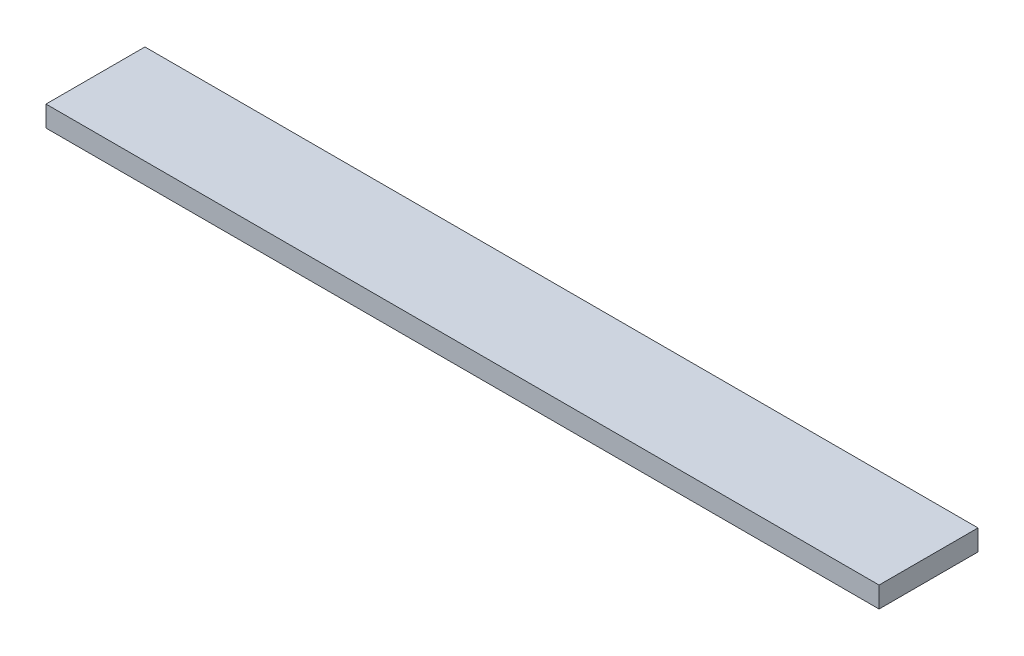
ISO-10303-21;
HEADER;
FILE_DESCRIPTION(('STEP AP214'),'2;1');
FILE_NAME('part.step','',(''),(''),'','','');
FILE_SCHEMA(('AUTOMOTIVE_DESIGN { 1 0 10303 214 1 1 1 1 }'));
ENDSEC;
DATA;
#1=APPLICATION_CONTEXT('core data for automotive mechanical design processes');
#2=APPLICATION_PROTOCOL_DEFINITION('international standard','automotive_design',2000,#1);
#3=PRODUCT_CONTEXT('',#1,'mechanical');
#4=PRODUCT('Part','Part','',(#3));
#5=PRODUCT_RELATED_PRODUCT_CATEGORY('part','',(#4));
#6=PRODUCT_DEFINITION_FORMATION('','',#4);
#7=PRODUCT_DEFINITION_CONTEXT('part definition',#1,'design');
#8=PRODUCT_DEFINITION('design','',#6,#7);
#9=PRODUCT_DEFINITION_SHAPE('','',#8);
#10=(LENGTH_UNIT() NAMED_UNIT(*) SI_UNIT(.MILLI.,.METRE.));
#11=(NAMED_UNIT(*) PLANE_ANGLE_UNIT() SI_UNIT($,.RADIAN.));
#12=(NAMED_UNIT(*) SI_UNIT($,.STERADIAN.) SOLID_ANGLE_UNIT());
#13=UNCERTAINTY_MEASURE_WITH_UNIT(LENGTH_MEASURE(1.E-05),#10,'distance_accuracy_value','');
#14=(GEOMETRIC_REPRESENTATION_CONTEXT(3) GLOBAL_UNCERTAINTY_ASSIGNED_CONTEXT((#13)) GLOBAL_UNIT_ASSIGNED_CONTEXT((#10,
#11,#12)) REPRESENTATION_CONTEXT('',''));
#15=CARTESIAN_POINT('',(0.,0.,0.));
#16=DIRECTION('',(0.,0.,1.));
#17=DIRECTION('',(1.,0.,0.));
#18=AXIS2_PLACEMENT_3D('',#15,#16,#17);
#19=CARTESIAN_POINT('',(0.,2.54,0.));
#20=DIRECTION('',(1.,0.,0.));
#21=DIRECTION('',(0.,0.,-1.));
#22=AXIS2_PLACEMENT_3D('',#19,#20,#21);
#23=PLANE('',#22);
#24=DIRECTION('',(0.,0.,1.));
#25=VECTOR('',#24,1.);
#26=CARTESIAN_POINT('',(0.,0.,0.));
#27=LINE('',#26,#25);
#28=CARTESIAN_POINT('',(0.,0.,-12.065));
#29=VERTEX_POINT('',#28);
#30=CARTESIAN_POINT('',(0.,0.,0.));
#31=VERTEX_POINT('',#30);
#32=EDGE_CURVE('E107',#29,#31,#27,.T.);
#33=ORIENTED_EDGE('',*,*,#32,.T.);
#34=DIRECTION('',(0.,-1.,0.));
#35=VECTOR('',#34,1.);
#36=CARTESIAN_POINT('',(0.,2.54,0.));
#37=LINE('',#36,#35);
#38=CARTESIAN_POINT('',(0.,2.54,0.));
#39=VERTEX_POINT('',#38);
#40=EDGE_CURVE('E11',#39,#31,#37,.T.);
#41=ORIENTED_EDGE('',*,*,#40,.F.);
#42=DIRECTION('',(0.,0.,1.));
#43=VECTOR('',#42,1.);
#44=CARTESIAN_POINT('',(0.,2.54,0.));
#45=LINE('',#44,#43);
#46=CARTESIAN_POINT('',(0.,2.54,-12.065));
#47=VERTEX_POINT('',#46);
#48=EDGE_CURVE('E91',#47,#39,#45,.T.);
#49=ORIENTED_EDGE('',*,*,#48,.F.);
#50=DIRECTION('',(0.,-1.,0.));
#51=VECTOR('',#50,1.);
#52=CARTESIAN_POINT('',(0.,2.54,-12.065));
#53=LINE('',#52,#51);
#54=EDGE_CURVE('E103',#47,#29,#53,.T.);
#55=ORIENTED_EDGE('',*,*,#54,.T.);
#56=EDGE_LOOP('',(#33,#41,#49,#55));
#57=FACE_BOUND('',#56,.T.);
#58=ADVANCED_FACE('F39',(#57),#23,.F.);
#59=CARTESIAN_POINT('',(0.,2.54,0.));
#60=DIRECTION('',(0.,0.,-1.));
#61=DIRECTION('',(-1.,0.,0.));
#62=AXIS2_PLACEMENT_3D('',#59,#60,#61);
#63=PLANE('',#62);
#64=DIRECTION('',(1.,0.,0.));
#65=VECTOR('',#64,1.);
#66=CARTESIAN_POINT('',(0.,0.,0.));
#67=LINE('',#66,#65);
#68=CARTESIAN_POINT('',(101.6,0.,0.));
#69=VERTEX_POINT('',#68);
#70=EDGE_CURVE('E96',#31,#69,#67,.T.);
#71=ORIENTED_EDGE('',*,*,#70,.T.);
#72=DIRECTION('',(0.,-1.,0.));
#73=VECTOR('',#72,1.);
#74=CARTESIAN_POINT('',(101.6,2.54,0.));
#75=LINE('',#74,#73);
#76=CARTESIAN_POINT('',(101.6,2.54,0.));
#77=VERTEX_POINT('',#76);
#78=EDGE_CURVE('E48',#77,#69,#75,.T.);
#79=ORIENTED_EDGE('',*,*,#78,.F.);
#80=DIRECTION('',(1.,0.,0.));
#81=VECTOR('',#80,1.);
#82=CARTESIAN_POINT('',(0.,2.54,0.));
#83=LINE('',#82,#81);
#84=EDGE_CURVE('E86',#39,#77,#83,.T.);
#85=ORIENTED_EDGE('',*,*,#84,.F.);
#86=ORIENTED_EDGE('',*,*,#40,.T.);
#87=EDGE_LOOP('',(#71,#79,#85,#86));
#88=FACE_BOUND('',#87,.T.);
#89=ADVANCED_FACE('F95',(#88),#63,.F.);
#90=CARTESIAN_POINT('',(101.6,2.54,0.));
#91=DIRECTION('',(-1.,0.,0.));
#92=DIRECTION('',(0.,0.,1.));
#93=AXIS2_PLACEMENT_3D('',#90,#91,#92);
#94=PLANE('',#93);
#95=DIRECTION('',(0.,0.,-1.));
#96=VECTOR('',#95,1.);
#97=CARTESIAN_POINT('',(101.6,0.,0.));
#98=LINE('',#97,#96);
#99=CARTESIAN_POINT('',(101.6,0.,-12.065));
#100=VERTEX_POINT('',#99);
#101=EDGE_CURVE('E73',#69,#100,#98,.T.);
#102=ORIENTED_EDGE('',*,*,#101,.T.);
#103=DIRECTION('',(0.,-1.,0.));
#104=VECTOR('',#103,1.);
#105=CARTESIAN_POINT('',(101.6,2.54,-12.065));
#106=LINE('',#105,#104);
#107=CARTESIAN_POINT('',(101.6,2.54,-12.065));
#108=VERTEX_POINT('',#107);
#109=EDGE_CURVE('E98',#108,#100,#106,.T.);
#110=ORIENTED_EDGE('',*,*,#109,.F.);
#111=DIRECTION('',(0.,0.,-1.));
#112=VECTOR('',#111,1.);
#113=CARTESIAN_POINT('',(101.6,2.54,0.));
#114=LINE('',#113,#112);
#115=EDGE_CURVE('E89',#77,#108,#114,.T.);
#116=ORIENTED_EDGE('',*,*,#115,.F.);
#117=ORIENTED_EDGE('',*,*,#78,.T.);
#118=EDGE_LOOP('',(#102,#110,#116,#117));
#119=FACE_BOUND('',#118,.T.);
#120=ADVANCED_FACE('F99',(#119),#94,.F.);
#121=CARTESIAN_POINT('',(0.,2.54,-12.065));
#122=DIRECTION('',(0.,0.,1.));
#123=DIRECTION('',(1.,0.,0.));
#124=AXIS2_PLACEMENT_3D('',#121,#122,#123);
#125=PLANE('',#124);
#126=DIRECTION('',(-1.,0.,0.));
#127=VECTOR('',#126,1.);
#128=CARTESIAN_POINT('',(0.,0.,-12.065));
#129=LINE('',#128,#127);
#130=EDGE_CURVE('E79',#100,#29,#129,.T.);
#131=ORIENTED_EDGE('',*,*,#130,.T.);
#132=ORIENTED_EDGE('',*,*,#54,.F.);
#133=DIRECTION('',(-1.,0.,0.));
#134=VECTOR('',#133,1.);
#135=CARTESIAN_POINT('',(0.,2.54,-12.065));
#136=LINE('',#135,#134);
#137=EDGE_CURVE('E56',#108,#47,#136,.T.);
#138=ORIENTED_EDGE('',*,*,#137,.F.);
#139=ORIENTED_EDGE('',*,*,#109,.T.);
#140=EDGE_LOOP('',(#131,#132,#138,#139));
#141=FACE_BOUND('',#140,.T.);
#142=ADVANCED_FACE('F120',(#141),#125,.F.);
#143=CARTESIAN_POINT('',(0.,2.54,0.));
#144=DIRECTION('',(0.,-1.,0.));
#145=DIRECTION('',(0.,0.,-1.));
#146=AXIS2_PLACEMENT_3D('',#143,#144,#145);
#147=PLANE('',#146);
#148=ORIENTED_EDGE('',*,*,#48,.T.);
#149=ORIENTED_EDGE('',*,*,#84,.T.);
#150=ORIENTED_EDGE('',*,*,#115,.T.);
#151=ORIENTED_EDGE('',*,*,#137,.T.);
#152=EDGE_LOOP('',(#148,#149,#150,#151));
#153=FACE_BOUND('',#152,.T.);
#154=ADVANCED_FACE('F87',(#153),#147,.F.);
#155=CARTESIAN_POINT('',(0.,0.,0.));
#156=DIRECTION('',(0.,-1.,0.));
#157=DIRECTION('',(0.,0.,-1.));
#158=AXIS2_PLACEMENT_3D('',#155,#156,#157);
#159=PLANE('',#158);
#160=ORIENTED_EDGE('',*,*,#32,.F.);
#161=ORIENTED_EDGE('',*,*,#130,.F.);
#162=ORIENTED_EDGE('',*,*,#101,.F.);
#163=ORIENTED_EDGE('',*,*,#70,.F.);
#164=EDGE_LOOP('',(#160,#161,#162,#163));
#165=FACE_BOUND('',#164,.T.);
#166=ADVANCED_FACE('F123',(#165),#159,.T.);
#167=CLOSED_SHELL('',(#58,#89,#120,#142,#154,#166));
#168=MANIFOLD_SOLID_BREP('B2',#167);
#169=ADVANCED_BREP_SHAPE_REPRESENTATION('',(#18,#168),#14);
#170=SHAPE_DEFINITION_REPRESENTATION(#9,#169);
ENDSEC;
END-ISO-10303-21;
